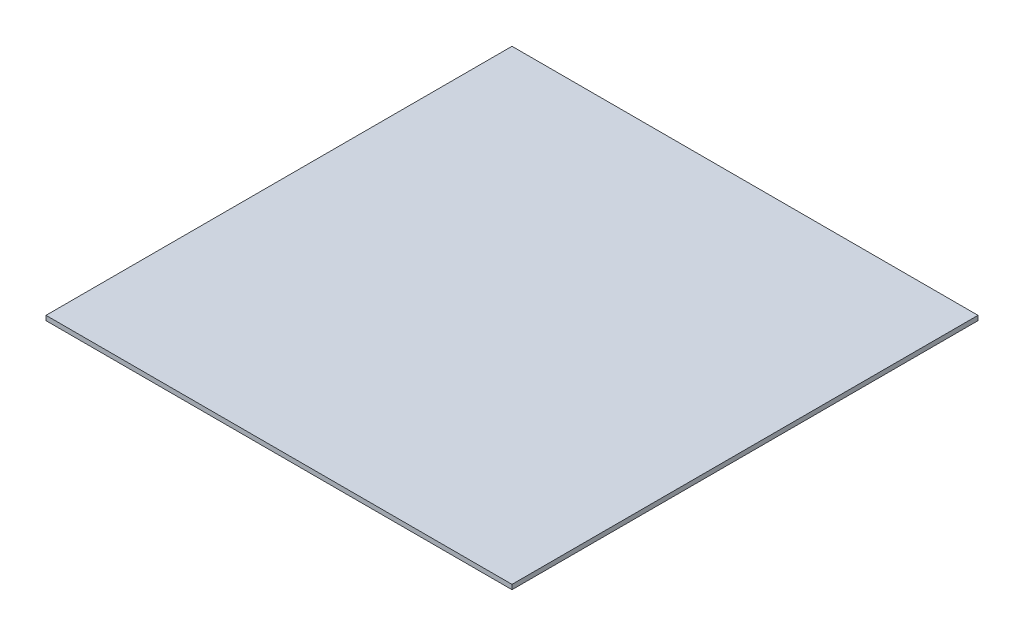
ISO-10303-21;
HEADER;
FILE_DESCRIPTION(('STEP AP214'),'2;1');
FILE_NAME('part.step','',(''),(''),'','','');
FILE_SCHEMA(('AUTOMOTIVE_DESIGN { 1 0 10303 214 1 1 1 1 }'));
ENDSEC;
DATA;
#1=APPLICATION_CONTEXT('core data for automotive mechanical design processes');
#2=APPLICATION_PROTOCOL_DEFINITION('international standard','automotive_design',2000,#1);
#3=PRODUCT_CONTEXT('',#1,'mechanical');
#4=PRODUCT('Part','Part','',(#3));
#5=PRODUCT_RELATED_PRODUCT_CATEGORY('part','',(#4));
#6=PRODUCT_DEFINITION_FORMATION('','',#4);
#7=PRODUCT_DEFINITION_CONTEXT('part definition',#1,'design');
#8=PRODUCT_DEFINITION('design','',#6,#7);
#9=PRODUCT_DEFINITION_SHAPE('','',#8);
#10=(LENGTH_UNIT() NAMED_UNIT(*) SI_UNIT(.MILLI.,.METRE.));
#11=(NAMED_UNIT(*) PLANE_ANGLE_UNIT() SI_UNIT($,.RADIAN.));
#12=(NAMED_UNIT(*) SI_UNIT($,.STERADIAN.) SOLID_ANGLE_UNIT());
#13=UNCERTAINTY_MEASURE_WITH_UNIT(LENGTH_MEASURE(1.E-05),#10,'distance_accuracy_value','');
#14=(GEOMETRIC_REPRESENTATION_CONTEXT(3) GLOBAL_UNCERTAINTY_ASSIGNED_CONTEXT((#13)) GLOBAL_UNIT_ASSIGNED_CONTEXT((#10,
#11,#12)) REPRESENTATION_CONTEXT('',''));
#15=CARTESIAN_POINT('',(0.,0.,0.));
#16=DIRECTION('',(0.,0.,1.));
#17=DIRECTION('',(1.,0.,0.));
#18=AXIS2_PLACEMENT_3D('',#15,#16,#17);
#19=CARTESIAN_POINT('',(1270.,25.4,-1270.));
#20=DIRECTION('',(-1.,0.,0.));
#21=DIRECTION('',(0.,0.,1.));
#22=AXIS2_PLACEMENT_3D('',#19,#20,#21);
#23=PLANE('',#22);
#24=DIRECTION('',(0.,0.,-1.));
#25=VECTOR('',#24,1.);
#26=CARTESIAN_POINT('',(1270.,0.,-1270.));
#27=LINE('',#26,#25);
#28=CARTESIAN_POINT('',(1270.,0.,1270.));
#29=VERTEX_POINT('',#28);
#30=CARTESIAN_POINT('',(1270.,0.,-1270.));
#31=VERTEX_POINT('',#30);
#32=EDGE_CURVE('E96',#29,#31,#27,.T.);
#33=ORIENTED_EDGE('',*,*,#32,.T.);
#34=DIRECTION('',(0.,-1.,0.));
#35=VECTOR('',#34,1.);
#36=CARTESIAN_POINT('',(1270.,25.4,-1270.));
#37=LINE('',#36,#35);
#38=CARTESIAN_POINT('',(1270.,25.4,-1270.));
#39=VERTEX_POINT('',#38);
#40=EDGE_CURVE('E11',#39,#31,#37,.T.);
#41=ORIENTED_EDGE('',*,*,#40,.F.);
#42=DIRECTION('',(0.,0.,-1.));
#43=VECTOR('',#42,1.);
#44=CARTESIAN_POINT('',(1270.,25.4,-1270.));
#45=LINE('',#44,#43);
#46=CARTESIAN_POINT('',(1270.,25.4,1270.));
#47=VERTEX_POINT('',#46);
#48=EDGE_CURVE('E84',#47,#39,#45,.T.);
#49=ORIENTED_EDGE('',*,*,#48,.F.);
#50=DIRECTION('',(0.,-1.,0.));
#51=VECTOR('',#50,1.);
#52=CARTESIAN_POINT('',(1270.,25.4,1270.));
#53=LINE('',#52,#51);
#54=EDGE_CURVE('E92',#47,#29,#53,.T.);
#55=ORIENTED_EDGE('',*,*,#54,.T.);
#56=EDGE_LOOP('',(#33,#41,#49,#55));
#57=FACE_BOUND('',#56,.T.);
#58=ADVANCED_FACE('F33',(#57),#23,.F.);
#59=CARTESIAN_POINT('',(-1270.,25.4,-1270.));
#60=DIRECTION('',(0.,0.,1.));
#61=DIRECTION('',(1.,0.,0.));
#62=AXIS2_PLACEMENT_3D('',#59,#60,#61);
#63=PLANE('',#62);
#64=DIRECTION('',(-1.,0.,0.));
#65=VECTOR('',#64,1.);
#66=CARTESIAN_POINT('',(-1270.,0.,-1270.));
#67=LINE('',#66,#65);
#68=CARTESIAN_POINT('',(-1270.,0.,-1270.));
#69=VERTEX_POINT('',#68);
#70=EDGE_CURVE('E88',#31,#69,#67,.T.);
#71=ORIENTED_EDGE('',*,*,#70,.T.);
#72=DIRECTION('',(0.,-1.,0.));
#73=VECTOR('',#72,1.);
#74=CARTESIAN_POINT('',(-1270.,25.4,-1270.));
#75=LINE('',#74,#73);
#76=CARTESIAN_POINT('',(-1270.,25.4,-1270.));
#77=VERTEX_POINT('',#76);
#78=EDGE_CURVE('E41',#77,#69,#75,.T.);
#79=ORIENTED_EDGE('',*,*,#78,.F.);
#80=DIRECTION('',(-1.,0.,0.));
#81=VECTOR('',#80,1.);
#82=CARTESIAN_POINT('',(-1270.,25.4,-1270.));
#83=LINE('',#82,#81);
#84=EDGE_CURVE('E79',#39,#77,#83,.T.);
#85=ORIENTED_EDGE('',*,*,#84,.F.);
#86=ORIENTED_EDGE('',*,*,#40,.T.);
#87=EDGE_LOOP('',(#71,#79,#85,#86));
#88=FACE_BOUND('',#87,.T.);
#89=ADVANCED_FACE('F87',(#88),#63,.F.);
#90=CARTESIAN_POINT('',(-1270.,25.4,-1270.));
#91=DIRECTION('',(1.,0.,0.));
#92=DIRECTION('',(0.,0.,-1.));
#93=AXIS2_PLACEMENT_3D('',#90,#91,#92);
#94=PLANE('',#93);
#95=DIRECTION('',(0.,0.,1.));
#96=VECTOR('',#95,1.);
#97=CARTESIAN_POINT('',(-1270.,0.,-1270.));
#98=LINE('',#97,#96);
#99=CARTESIAN_POINT('',(-1270.,0.,1270.));
#100=VERTEX_POINT('',#99);
#101=EDGE_CURVE('E66',#69,#100,#98,.T.);
#102=ORIENTED_EDGE('',*,*,#101,.T.);
#103=DIRECTION('',(0.,-1.,0.));
#104=VECTOR('',#103,1.);
#105=CARTESIAN_POINT('',(-1270.,25.4,1270.));
#106=LINE('',#105,#104);
#107=CARTESIAN_POINT('',(-1270.,25.4,1270.));
#108=VERTEX_POINT('',#107);
#109=EDGE_CURVE('E89',#108,#100,#106,.T.);
#110=ORIENTED_EDGE('',*,*,#109,.F.);
#111=DIRECTION('',(0.,0.,1.));
#112=VECTOR('',#111,1.);
#113=CARTESIAN_POINT('',(-1270.,25.4,-1270.));
#114=LINE('',#113,#112);
#115=EDGE_CURVE('E82',#77,#108,#114,.T.);
#116=ORIENTED_EDGE('',*,*,#115,.F.);
#117=ORIENTED_EDGE('',*,*,#78,.T.);
#118=EDGE_LOOP('',(#102,#110,#116,#117));
#119=FACE_BOUND('',#118,.T.);
#120=ADVANCED_FACE('F90',(#119),#94,.F.);
#121=CARTESIAN_POINT('',(-1270.,25.4,1270.));
#122=DIRECTION('',(0.,0.,-1.));
#123=DIRECTION('',(-1.,0.,0.));
#124=AXIS2_PLACEMENT_3D('',#121,#122,#123);
#125=PLANE('',#124);
#126=DIRECTION('',(1.,0.,0.));
#127=VECTOR('',#126,1.);
#128=CARTESIAN_POINT('',(-1270.,0.,1270.));
#129=LINE('',#128,#127);
#130=EDGE_CURVE('E72',#100,#29,#129,.T.);
#131=ORIENTED_EDGE('',*,*,#130,.T.);
#132=ORIENTED_EDGE('',*,*,#54,.F.);
#133=DIRECTION('',(1.,0.,0.));
#134=VECTOR('',#133,1.);
#135=CARTESIAN_POINT('',(-1270.,25.4,1270.));
#136=LINE('',#135,#134);
#137=EDGE_CURVE('E49',#108,#47,#136,.T.);
#138=ORIENTED_EDGE('',*,*,#137,.F.);
#139=ORIENTED_EDGE('',*,*,#109,.T.);
#140=EDGE_LOOP('',(#131,#132,#138,#139));
#141=FACE_BOUND('',#140,.T.);
#142=ADVANCED_FACE('F103',(#141),#125,.F.);
#143=CARTESIAN_POINT('',(0.,25.4,0.));
#144=DIRECTION('',(0.,1.,0.));
#145=DIRECTION('',(0.,0.,1.));
#146=AXIS2_PLACEMENT_3D('',#143,#144,#145);
#147=PLANE('',#146);
#148=ORIENTED_EDGE('',*,*,#48,.T.);
#149=ORIENTED_EDGE('',*,*,#84,.T.);
#150=ORIENTED_EDGE('',*,*,#115,.T.);
#151=ORIENTED_EDGE('',*,*,#137,.T.);
#152=EDGE_LOOP('',(#148,#149,#150,#151));
#153=FACE_BOUND('',#152,.T.);
#154=ADVANCED_FACE('F80',(#153),#147,.T.);
#155=CARTESIAN_POINT('',(0.,0.,0.));
#156=DIRECTION('',(0.,1.,0.));
#157=DIRECTION('',(0.,0.,1.));
#158=AXIS2_PLACEMENT_3D('',#155,#156,#157);
#159=PLANE('',#158);
#160=ORIENTED_EDGE('',*,*,#32,.F.);
#161=ORIENTED_EDGE('',*,*,#130,.F.);
#162=ORIENTED_EDGE('',*,*,#101,.F.);
#163=ORIENTED_EDGE('',*,*,#70,.F.);
#164=EDGE_LOOP('',(#160,#161,#162,#163));
#165=FACE_BOUND('',#164,.T.);
#166=ADVANCED_FACE('F106',(#165),#159,.F.);
#167=CLOSED_SHELL('',(#58,#89,#120,#142,#154,#166));
#168=MANIFOLD_SOLID_BREP('B2',#167);
#169=ADVANCED_BREP_SHAPE_REPRESENTATION('',(#18,#168),#14);
#170=SHAPE_DEFINITION_REPRESENTATION(#9,#169);
ENDSEC;
END-ISO-10303-21;
